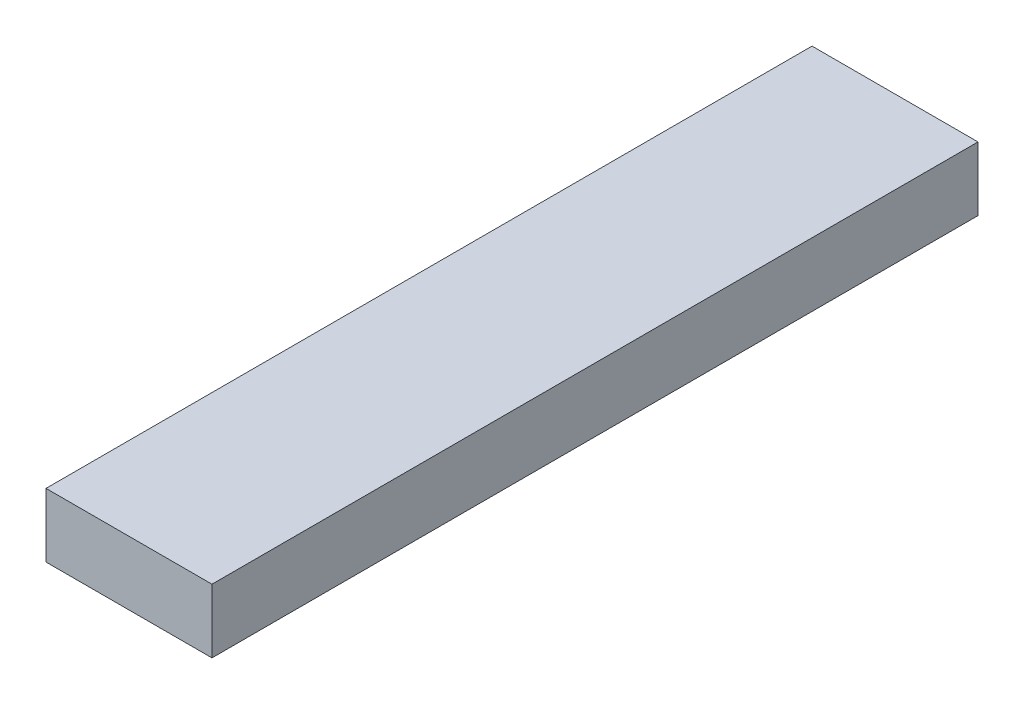
ISO-10303-21;
HEADER;
FILE_DESCRIPTION(('STEP AP214'),'2;1');
FILE_NAME('part.step','',(''),(''),'','','');
FILE_SCHEMA(('AUTOMOTIVE_DESIGN { 1 0 10303 214 1 1 1 1 }'));
ENDSEC;
DATA;
#1=APPLICATION_CONTEXT('core data for automotive mechanical design processes');
#2=APPLICATION_PROTOCOL_DEFINITION('international standard','automotive_design',2000,#1);
#3=PRODUCT_CONTEXT('',#1,'mechanical');
#4=PRODUCT('Part','Part','',(#3));
#5=PRODUCT_RELATED_PRODUCT_CATEGORY('part','',(#4));
#6=PRODUCT_DEFINITION_FORMATION('','',#4);
#7=PRODUCT_DEFINITION_CONTEXT('part definition',#1,'design');
#8=PRODUCT_DEFINITION('design','',#6,#7);
#9=PRODUCT_DEFINITION_SHAPE('','',#8);
#10=(LENGTH_UNIT() NAMED_UNIT(*) SI_UNIT(.MILLI.,.METRE.));
#11=(NAMED_UNIT(*) PLANE_ANGLE_UNIT() SI_UNIT($,.RADIAN.));
#12=(NAMED_UNIT(*) SI_UNIT($,.STERADIAN.) SOLID_ANGLE_UNIT());
#13=UNCERTAINTY_MEASURE_WITH_UNIT(LENGTH_MEASURE(1.E-05),#10,'distance_accuracy_value','');
#14=(GEOMETRIC_REPRESENTATION_CONTEXT(3) GLOBAL_UNCERTAINTY_ASSIGNED_CONTEXT((#13)) GLOBAL_UNIT_ASSIGNED_CONTEXT((#10,
#11,#12)) REPRESENTATION_CONTEXT('',''));
#15=CARTESIAN_POINT('',(0.,0.,0.));
#16=DIRECTION('',(0.,0.,1.));
#17=DIRECTION('',(1.,0.,0.));
#18=AXIS2_PLACEMENT_3D('',#15,#16,#17);
#19=CARTESIAN_POINT('',(0.,0.,60.));
#20=DIRECTION('',(1.,0.,0.));
#21=DIRECTION('',(0.,1.,0.));
#22=AXIS2_PLACEMENT_3D('',#19,#20,#21);
#23=PLANE('',#22);
#24=DIRECTION('',(0.,-1.,0.));
#25=VECTOR('',#24,1.);
#26=CARTESIAN_POINT('',(0.,0.,0.));
#27=LINE('',#26,#25);
#28=CARTESIAN_POINT('',(0.,0.,0.));
#29=VERTEX_POINT('',#28);
#30=CARTESIAN_POINT('',(0.,-5.,0.));
#31=VERTEX_POINT('',#30);
#32=EDGE_CURVE('E96',#29,#31,#27,.T.);
#33=ORIENTED_EDGE('',*,*,#32,.T.);
#34=DIRECTION('',(0.,0.,-1.));
#35=VECTOR('',#34,1.);
#36=CARTESIAN_POINT('',(0.,-5.,60.));
#37=LINE('',#36,#35);
#38=CARTESIAN_POINT('',(0.,-5.,60.));
#39=VERTEX_POINT('',#38);
#40=EDGE_CURVE('E11',#39,#31,#37,.T.);
#41=ORIENTED_EDGE('',*,*,#40,.F.);
#42=DIRECTION('',(0.,-1.,0.));
#43=VECTOR('',#42,1.);
#44=CARTESIAN_POINT('',(0.,0.,60.));
#45=LINE('',#44,#43);
#46=CARTESIAN_POINT('',(0.,0.,60.));
#47=VERTEX_POINT('',#46);
#48=EDGE_CURVE('E84',#47,#39,#45,.T.);
#49=ORIENTED_EDGE('',*,*,#48,.F.);
#50=DIRECTION('',(0.,0.,-1.));
#51=VECTOR('',#50,1.);
#52=CARTESIAN_POINT('',(0.,0.,60.));
#53=LINE('',#52,#51);
#54=EDGE_CURVE('E92',#47,#29,#53,.T.);
#55=ORIENTED_EDGE('',*,*,#54,.T.);
#56=EDGE_LOOP('',(#33,#41,#49,#55));
#57=FACE_BOUND('',#56,.T.);
#58=ADVANCED_FACE('F33',(#57),#23,.F.);
#59=CARTESIAN_POINT('',(0.,-5.,60.));
#60=DIRECTION('',(0.,1.,0.));
#61=DIRECTION('',(0.,0.,1.));
#62=AXIS2_PLACEMENT_3D('',#59,#60,#61);
#63=PLANE('',#62);
#64=DIRECTION('',(1.,0.,0.));
#65=VECTOR('',#64,1.);
#66=CARTESIAN_POINT('',(0.,-5.,0.));
#67=LINE('',#66,#65);
#68=CARTESIAN_POINT('',(13.,-5.,0.));
#69=VERTEX_POINT('',#68);
#70=EDGE_CURVE('E88',#31,#69,#67,.T.);
#71=ORIENTED_EDGE('',*,*,#70,.T.);
#72=DIRECTION('',(0.,0.,-1.));
#73=VECTOR('',#72,1.);
#74=CARTESIAN_POINT('',(13.,-5.,60.));
#75=LINE('',#74,#73);
#76=CARTESIAN_POINT('',(13.,-5.,60.));
#77=VERTEX_POINT('',#76);
#78=EDGE_CURVE('E41',#77,#69,#75,.T.);
#79=ORIENTED_EDGE('',*,*,#78,.F.);
#80=DIRECTION('',(1.,0.,0.));
#81=VECTOR('',#80,1.);
#82=CARTESIAN_POINT('',(0.,-5.,60.));
#83=LINE('',#82,#81);
#84=EDGE_CURVE('E79',#39,#77,#83,.T.);
#85=ORIENTED_EDGE('',*,*,#84,.F.);
#86=ORIENTED_EDGE('',*,*,#40,.T.);
#87=EDGE_LOOP('',(#71,#79,#85,#86));
#88=FACE_BOUND('',#87,.T.);
#89=ADVANCED_FACE('F87',(#88),#63,.F.);
#90=CARTESIAN_POINT('',(13.,0.,60.));
#91=DIRECTION('',(-1.,0.,0.));
#92=DIRECTION('',(0.,0.,1.));
#93=AXIS2_PLACEMENT_3D('',#90,#91,#92);
#94=PLANE('',#93);
#95=DIRECTION('',(0.,1.,0.));
#96=VECTOR('',#95,1.);
#97=CARTESIAN_POINT('',(13.,0.,0.));
#98=LINE('',#97,#96);
#99=CARTESIAN_POINT('',(13.,0.,0.));
#100=VERTEX_POINT('',#99);
#101=EDGE_CURVE('E66',#69,#100,#98,.T.);
#102=ORIENTED_EDGE('',*,*,#101,.T.);
#103=DIRECTION('',(0.,0.,-1.));
#104=VECTOR('',#103,1.);
#105=CARTESIAN_POINT('',(13.,0.,60.));
#106=LINE('',#105,#104);
#107=CARTESIAN_POINT('',(13.,0.,60.));
#108=VERTEX_POINT('',#107);
#109=EDGE_CURVE('E89',#108,#100,#106,.T.);
#110=ORIENTED_EDGE('',*,*,#109,.F.);
#111=DIRECTION('',(0.,1.,0.));
#112=VECTOR('',#111,1.);
#113=CARTESIAN_POINT('',(13.,0.,60.));
#114=LINE('',#113,#112);
#115=EDGE_CURVE('E82',#77,#108,#114,.T.);
#116=ORIENTED_EDGE('',*,*,#115,.F.);
#117=ORIENTED_EDGE('',*,*,#78,.T.);
#118=EDGE_LOOP('',(#102,#110,#116,#117));
#119=FACE_BOUND('',#118,.T.);
#120=ADVANCED_FACE('F90',(#119),#94,.F.);
#121=CARTESIAN_POINT('',(0.,0.,60.));
#122=DIRECTION('',(0.,-1.,0.));
#123=DIRECTION('',(0.,0.,-1.));
#124=AXIS2_PLACEMENT_3D('',#121,#122,#123);
#125=PLANE('',#124);
#126=DIRECTION('',(-1.,0.,0.));
#127=VECTOR('',#126,1.);
#128=CARTESIAN_POINT('',(0.,0.,0.));
#129=LINE('',#128,#127);
#130=EDGE_CURVE('E72',#100,#29,#129,.T.);
#131=ORIENTED_EDGE('',*,*,#130,.T.);
#132=ORIENTED_EDGE('',*,*,#54,.F.);
#133=DIRECTION('',(-1.,0.,0.));
#134=VECTOR('',#133,1.);
#135=CARTESIAN_POINT('',(0.,0.,60.));
#136=LINE('',#135,#134);
#137=EDGE_CURVE('E49',#108,#47,#136,.T.);
#138=ORIENTED_EDGE('',*,*,#137,.F.);
#139=ORIENTED_EDGE('',*,*,#109,.T.);
#140=EDGE_LOOP('',(#131,#132,#138,#139));
#141=FACE_BOUND('',#140,.T.);
#142=ADVANCED_FACE('F103',(#141),#125,.F.);
#143=CARTESIAN_POINT('',(0.,0.,60.));
#144=DIRECTION('',(0.,0.,1.));
#145=DIRECTION('',(1.,0.,0.));
#146=AXIS2_PLACEMENT_3D('',#143,#144,#145);
#147=PLANE('',#146);
#148=ORIENTED_EDGE('',*,*,#48,.T.);
#149=ORIENTED_EDGE('',*,*,#84,.T.);
#150=ORIENTED_EDGE('',*,*,#115,.T.);
#151=ORIENTED_EDGE('',*,*,#137,.T.);
#152=EDGE_LOOP('',(#148,#149,#150,#151));
#153=FACE_BOUND('',#152,.T.);
#154=ADVANCED_FACE('F80',(#153),#147,.T.);
#155=CARTESIAN_POINT('',(0.,0.,0.));
#156=DIRECTION('',(0.,0.,1.));
#157=DIRECTION('',(1.,0.,0.));
#158=AXIS2_PLACEMENT_3D('',#155,#156,#157);
#159=PLANE('',#158);
#160=ORIENTED_EDGE('',*,*,#32,.F.);
#161=ORIENTED_EDGE('',*,*,#130,.F.);
#162=ORIENTED_EDGE('',*,*,#101,.F.);
#163=ORIENTED_EDGE('',*,*,#70,.F.);
#164=EDGE_LOOP('',(#160,#161,#162,#163));
#165=FACE_BOUND('',#164,.T.);
#166=ADVANCED_FACE('F106',(#165),#159,.F.);
#167=CLOSED_SHELL('',(#58,#89,#120,#142,#154,#166));
#168=MANIFOLD_SOLID_BREP('B2',#167);
#169=ADVANCED_BREP_SHAPE_REPRESENTATION('',(#18,#168),#14);
#170=SHAPE_DEFINITION_REPRESENTATION(#9,#169);
ENDSEC;
END-ISO-10303-21;
